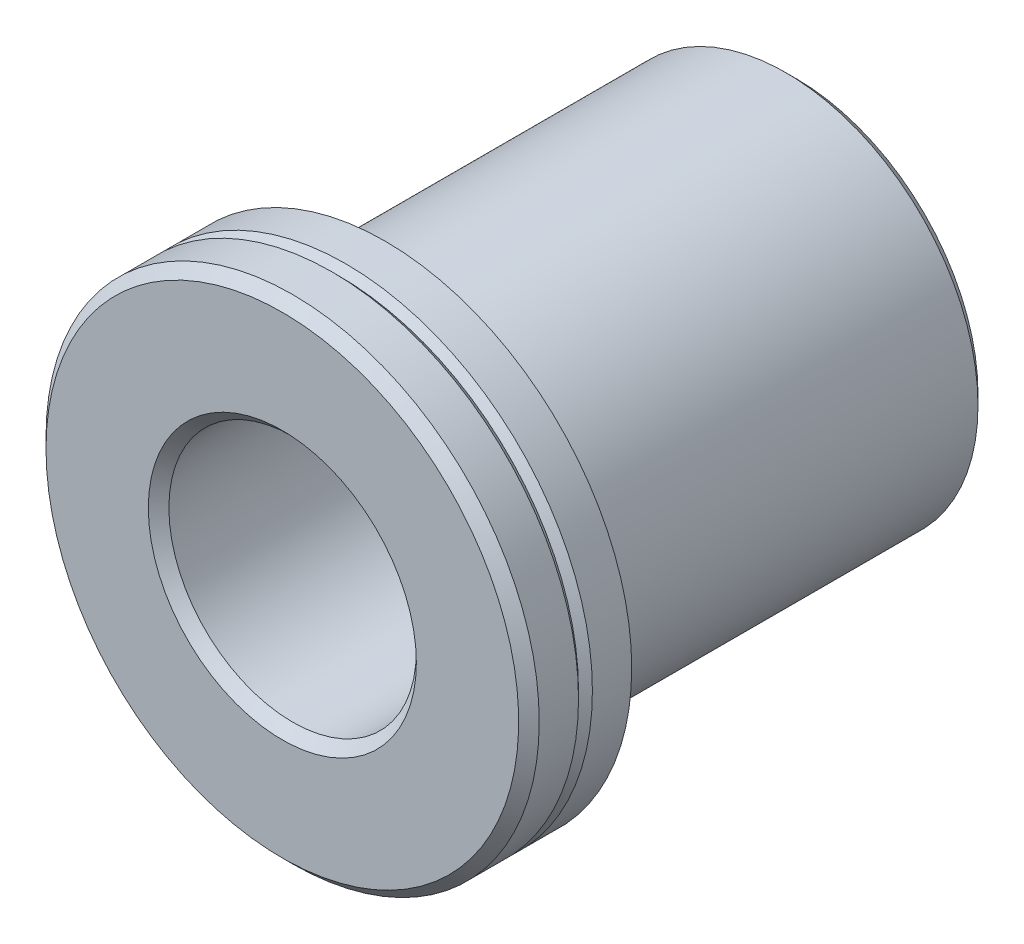
ISO-10303-21;
HEADER;
FILE_DESCRIPTION(('STEP AP214'),'2;1');
FILE_NAME('part.step','',(''),(''),'','','');
FILE_SCHEMA(('AUTOMOTIVE_DESIGN { 1 0 10303 214 1 1 1 1 }'));
ENDSEC;
DATA;
#1=APPLICATION_CONTEXT('core data for automotive mechanical design processes');
#2=APPLICATION_PROTOCOL_DEFINITION('international standard','automotive_design',2000,#1);
#3=PRODUCT_CONTEXT('',#1,'mechanical');
#4=PRODUCT('Part','Part','',(#3));
#5=PRODUCT_RELATED_PRODUCT_CATEGORY('part','',(#4));
#6=PRODUCT_DEFINITION_FORMATION('','',#4);
#7=PRODUCT_DEFINITION_CONTEXT('part definition',#1,'design');
#8=PRODUCT_DEFINITION('design','',#6,#7);
#9=PRODUCT_DEFINITION_SHAPE('','',#8);
#10=(LENGTH_UNIT() NAMED_UNIT(*) SI_UNIT(.MILLI.,.METRE.));
#11=(NAMED_UNIT(*) PLANE_ANGLE_UNIT() SI_UNIT($,.RADIAN.));
#12=(NAMED_UNIT(*) SI_UNIT($,.STERADIAN.) SOLID_ANGLE_UNIT());
#13=UNCERTAINTY_MEASURE_WITH_UNIT(LENGTH_MEASURE(1.E-05),#10,'distance_accuracy_value','');
#14=(GEOMETRIC_REPRESENTATION_CONTEXT(3) GLOBAL_UNCERTAINTY_ASSIGNED_CONTEXT((#13)) GLOBAL_UNIT_ASSIGNED_CONTEXT((#10,
#11,#12)) REPRESENTATION_CONTEXT('',''));
#15=CARTESIAN_POINT('',(0.,0.,0.));
#16=DIRECTION('',(0.,0.,1.));
#17=DIRECTION('',(1.,0.,0.));
#18=AXIS2_PLACEMENT_3D('',#15,#16,#17);
#19=CARTESIAN_POINT('',(0.,0.,6.35));
#20=DIRECTION('',(0.,0.,1.));
#21=DIRECTION('',(1.,0.,0.));
#22=AXIS2_PLACEMENT_3D('',#19,#20,#21);
#23=CYLINDRICAL_SURFACE('',#22,6.096);
#24=CARTESIAN_POINT('',(0.,0.,6.096));
#25=DIRECTION('',(0.,0.,-1.));
#26=DIRECTION('',(-1.,0.,0.));
#27=AXIS2_PLACEMENT_3D('',#24,#25,#26);
#28=CIRCLE('',#27,6.096);
#29=CARTESIAN_POINT('',(-6.096,0.,6.096));
#30=VERTEX_POINT('',#29);
#31=EDGE_CURVE('E9',#30,#30,#28,.T.);
#32=ORIENTED_EDGE('',*,*,#31,.T.);
#33=EDGE_LOOP('',(#32));
#34=FACE_BOUND('',#33,.T.);
#35=CARTESIAN_POINT('',(0.,0.,5.12445));
#36=DIRECTION('',(0.,0.,1.));
#37=DIRECTION('',(1.,0.,0.));
#38=AXIS2_PLACEMENT_3D('',#35,#36,#37);
#39=CIRCLE('',#38,6.096);
#40=CARTESIAN_POINT('',(6.096,0.,5.12445));
#41=VERTEX_POINT('',#40);
#42=EDGE_CURVE('E57',#41,#41,#39,.T.);
#43=ORIENTED_EDGE('',*,*,#42,.T.);
#44=EDGE_LOOP('',(#43));
#45=FACE_BOUND('',#44,.T.);
#46=ADVANCED_FACE('F13',(#34,#45),#23,.T.);
#47=CARTESIAN_POINT('',(0.,0.,3.81));
#48=DIRECTION('',(0.,0.,1.));
#49=DIRECTION('',(1.,0.,0.));
#50=AXIS2_PLACEMENT_3D('',#47,#48,#49);
#51=CIRCLE('',#50,6.096);
#52=CARTESIAN_POINT('',(6.096,0.,3.81));
#53=VERTEX_POINT('',#52);
#54=EDGE_CURVE('E45',#53,#53,#51,.T.);
#55=ORIENTED_EDGE('',*,*,#54,.T.);
#56=EDGE_LOOP('',(#55));
#57=FACE_BOUND('',#56,.T.);
#58=CARTESIAN_POINT('',(0.,0.,4.78155));
#59=DIRECTION('',(0.,0.,1.));
#60=DIRECTION('',(1.,0.,0.));
#61=AXIS2_PLACEMENT_3D('',#58,#59,#60);
#62=CIRCLE('',#61,6.096);
#63=CARTESIAN_POINT('',(6.096,0.,4.78155));
#64=VERTEX_POINT('',#63);
#65=EDGE_CURVE('E63',#64,#64,#62,.T.);
#66=ORIENTED_EDGE('',*,*,#65,.F.);
#67=EDGE_LOOP('',(#66));
#68=FACE_BOUND('',#67,.T.);
#69=ADVANCED_FACE('F70',(#57,#68),#23,.T.);
#70=CARTESIAN_POINT('',(0.,0.,6.35));
#71=DIRECTION('',(0.,0.,1.));
#72=DIRECTION('',(1.,0.,0.));
#73=AXIS2_PLACEMENT_3D('',#70,#71,#72);
#74=CYLINDRICAL_SURFACE('',#73,3.059);
#75=CARTESIAN_POINT('',(0.,0.,6.096));
#76=DIRECTION('',(0.,0.,-1.));
#77=DIRECTION('',(-1.,0.,0.));
#78=AXIS2_PLACEMENT_3D('',#75,#76,#77);
#79=CIRCLE('',#78,3.059);
#80=CARTESIAN_POINT('',(-3.059,0.,6.096));
#81=VERTEX_POINT('',#80);
#82=EDGE_CURVE('E39',#81,#81,#79,.F.);
#83=ORIENTED_EDGE('',*,*,#82,.T.);
#84=EDGE_LOOP('',(#83));
#85=FACE_BOUND('',#84,.T.);
#86=CARTESIAN_POINT('',(0.,0.,-6.096));
#87=DIRECTION('',(0.,0.,1.));
#88=DIRECTION('',(1.,0.,0.));
#89=AXIS2_PLACEMENT_3D('',#86,#87,#88);
#90=CIRCLE('',#89,3.059);
#91=CARTESIAN_POINT('',(3.059,0.,-6.096));
#92=VERTEX_POINT('',#91);
#93=EDGE_CURVE('E42',#92,#92,#90,.F.);
#94=ORIENTED_EDGE('',*,*,#93,.T.);
#95=EDGE_LOOP('',(#94));
#96=FACE_BOUND('',#95,.T.);
#97=ADVANCED_FACE('F72',(#85,#96),#74,.F.);
#98=CARTESIAN_POINT('',(0.,3.059,6.35));
#99=DIRECTION('',(0.,0.,-1.));
#100=DIRECTION('',(-1.,0.,0.));
#101=AXIS2_PLACEMENT_3D('',#98,#99,#100);
#102=PLANE('',#101);
#103=CARTESIAN_POINT('',(0.,0.,6.35));
#104=DIRECTION('',(0.,0.,-1.));
#105=DIRECTION('',(-1.,0.,0.));
#106=AXIS2_PLACEMENT_3D('',#103,#104,#105);
#107=CIRCLE('',#106,3.31299999999999);
#108=CARTESIAN_POINT('',(-3.31299999999999,0.,6.35));
#109=VERTEX_POINT('',#108);
#110=EDGE_CURVE('E33',#109,#109,#107,.T.);
#111=ORIENTED_EDGE('',*,*,#110,.T.);
#112=EDGE_LOOP('',(#111));
#113=FACE_BOUND('',#112,.T.);
#114=CARTESIAN_POINT('',(0.,0.,6.35));
#115=DIRECTION('',(0.,0.,-1.));
#116=DIRECTION('',(-1.,0.,0.));
#117=AXIS2_PLACEMENT_3D('',#114,#115,#116);
#118=CIRCLE('',#117,5.842);
#119=CARTESIAN_POINT('',(-5.842,0.,6.35));
#120=VERTEX_POINT('',#119);
#121=EDGE_CURVE('E36',#120,#120,#118,.F.);
#122=ORIENTED_EDGE('',*,*,#121,.T.);
#123=EDGE_LOOP('',(#122));
#124=FACE_BOUND('',#123,.T.);
#125=ADVANCED_FACE('F80',(#113,#124),#102,.F.);
#126=CARTESIAN_POINT('',(0.,6.096,3.81));
#127=DIRECTION('',(0.,0.,1.));
#128=DIRECTION('',(1.,0.,0.));
#129=AXIS2_PLACEMENT_3D('',#126,#127,#128);
#130=PLANE('',#129);
#131=ORIENTED_EDGE('',*,*,#54,.F.);
#132=EDGE_LOOP('',(#131));
#133=FACE_BOUND('',#132,.T.);
#134=CARTESIAN_POINT('',(0.,0.,3.81));
#135=DIRECTION('',(0.,0.,1.));
#136=DIRECTION('',(1.,0.,0.));
#137=AXIS2_PLACEMENT_3D('',#134,#135,#136);
#138=CIRCLE('',#137,4.4958);
#139=CARTESIAN_POINT('',(4.4958,0.,3.81));
#140=VERTEX_POINT('',#139);
#141=EDGE_CURVE('E48',#140,#140,#138,.T.);
#142=ORIENTED_EDGE('',*,*,#141,.T.);
#143=EDGE_LOOP('',(#142));
#144=FACE_BOUND('',#143,.T.);
#145=ADVANCED_FACE('F85',(#133,#144),#130,.F.);
#146=CARTESIAN_POINT('',(0.,0.,6.35));
#147=DIRECTION('',(0.,0.,1.));
#148=DIRECTION('',(1.,0.,0.));
#149=AXIS2_PLACEMENT_3D('',#146,#147,#148);
#150=CYLINDRICAL_SURFACE('',#149,4.4958);
#151=ORIENTED_EDGE('',*,*,#141,.F.);
#152=EDGE_LOOP('',(#151));
#153=FACE_BOUND('',#152,.T.);
#154=CARTESIAN_POINT('',(0.,0.,3.048));
#155=DIRECTION('',(0.,0.,1.));
#156=DIRECTION('',(1.,0.,0.));
#157=AXIS2_PLACEMENT_3D('',#154,#155,#156);
#158=CIRCLE('',#157,4.4958);
#159=CARTESIAN_POINT('',(4.4958,0.,3.048));
#160=VERTEX_POINT('',#159);
#161=EDGE_CURVE('E51',#160,#160,#158,.T.);
#162=ORIENTED_EDGE('',*,*,#161,.T.);
#163=EDGE_LOOP('',(#162));
#164=FACE_BOUND('',#163,.T.);
#165=ADVANCED_FACE('F122',(#153,#164),#150,.T.);
#166=CARTESIAN_POINT('',(0.,4.4958,3.048));
#167=DIRECTION('',(0.,0.,-1.));
#168=DIRECTION('',(-1.,0.,0.));
#169=AXIS2_PLACEMENT_3D('',#166,#167,#168);
#170=PLANE('',#169);
#171=ORIENTED_EDGE('',*,*,#161,.F.);
#172=EDGE_LOOP('',(#171));
#173=FACE_BOUND('',#172,.T.);
#174=CARTESIAN_POINT('',(0.,0.,3.048));
#175=DIRECTION('',(0.,0.,1.));
#176=DIRECTION('',(1.,0.,0.));
#177=AXIS2_PLACEMENT_3D('',#174,#175,#176);
#178=CIRCLE('',#177,4.7498);
#179=CARTESIAN_POINT('',(4.7498,0.,3.048));
#180=VERTEX_POINT('',#179);
#181=EDGE_CURVE('E54',#180,#180,#178,.T.);
#182=ORIENTED_EDGE('',*,*,#181,.T.);
#183=EDGE_LOOP('',(#182));
#184=FACE_BOUND('',#183,.T.);
#185=ADVANCED_FACE('F116',(#173,#184),#170,.F.);
#186=CARTESIAN_POINT('',(0.,0.,6.35));
#187=DIRECTION('',(0.,0.,1.));
#188=DIRECTION('',(1.,0.,0.));
#189=AXIS2_PLACEMENT_3D('',#186,#187,#188);
#190=CYLINDRICAL_SURFACE('',#189,4.7498);
#191=CARTESIAN_POINT('',(0.,0.,-6.096));
#192=DIRECTION('',(0.,0.,1.));
#193=DIRECTION('',(1.,0.,0.));
#194=AXIS2_PLACEMENT_3D('',#191,#192,#193);
#195=CIRCLE('',#194,4.7498);
#196=CARTESIAN_POINT('',(4.7498,0.,-6.096));
#197=VERTEX_POINT('',#196);
#198=EDGE_CURVE('E20',#197,#197,#195,.T.);
#199=ORIENTED_EDGE('',*,*,#198,.T.);
#200=EDGE_LOOP('',(#199));
#201=FACE_BOUND('',#200,.T.);
#202=ORIENTED_EDGE('',*,*,#181,.F.);
#203=EDGE_LOOP('',(#202));
#204=FACE_BOUND('',#203,.T.);
#205=ADVANCED_FACE('F110',(#201,#204),#190,.T.);
#206=CARTESIAN_POINT('',(0.,4.7498,-6.35));
#207=DIRECTION('',(0.,0.,1.));
#208=DIRECTION('',(1.,0.,0.));
#209=AXIS2_PLACEMENT_3D('',#206,#207,#208);
#210=PLANE('',#209);
#211=CARTESIAN_POINT('',(0.,0.,-6.35));
#212=DIRECTION('',(0.,0.,1.));
#213=DIRECTION('',(1.,0.,0.));
#214=AXIS2_PLACEMENT_3D('',#211,#212,#213);
#215=CIRCLE('',#214,3.313);
#216=CARTESIAN_POINT('',(3.313,0.,-6.35));
#217=VERTEX_POINT('',#216);
#218=EDGE_CURVE('E24',#217,#217,#215,.T.);
#219=ORIENTED_EDGE('',*,*,#218,.T.);
#220=EDGE_LOOP('',(#219));
#221=FACE_BOUND('',#220,.T.);
#222=CARTESIAN_POINT('',(0.,0.,-6.35));
#223=DIRECTION('',(0.,0.,1.));
#224=DIRECTION('',(1.,0.,0.));
#225=AXIS2_PLACEMENT_3D('',#222,#223,#224);
#226=CIRCLE('',#225,4.4958);
#227=CARTESIAN_POINT('',(4.4958,0.,-6.35));
#228=VERTEX_POINT('',#227);
#229=EDGE_CURVE('E28',#228,#228,#226,.F.);
#230=ORIENTED_EDGE('',*,*,#229,.T.);
#231=EDGE_LOOP('',(#230));
#232=FACE_BOUND('',#231,.T.);
#233=ADVANCED_FACE('F94',(#221,#232),#210,.F.);
#234=CARTESIAN_POINT('',(0.,0.,6.096));
#235=DIRECTION('',(0.,0.,1.));
#236=DIRECTION('',(1.,0.,0.));
#237=AXIS2_PLACEMENT_3D('',#234,#235,#236);
#238=CONICAL_SURFACE('',#237,3.059,0.785398163397445);
#239=ORIENTED_EDGE('',*,*,#110,.F.);
#240=EDGE_LOOP('',(#239));
#241=FACE_BOUND('',#240,.T.);
#242=ORIENTED_EDGE('',*,*,#82,.F.);
#243=EDGE_LOOP('',(#242));
#244=FACE_BOUND('',#243,.T.);
#245=ADVANCED_FACE('F90',(#241,#244),#238,.F.);
#246=CARTESIAN_POINT('',(0.,0.,-6.35));
#247=DIRECTION('',(0.,0.,-1.));
#248=DIRECTION('',(-1.,0.,0.));
#249=AXIS2_PLACEMENT_3D('',#246,#247,#248);
#250=CONICAL_SURFACE('',#249,3.313,0.785398163397443);
#251=ORIENTED_EDGE('',*,*,#93,.F.);
#252=EDGE_LOOP('',(#251));
#253=FACE_BOUND('',#252,.T.);
#254=ORIENTED_EDGE('',*,*,#218,.F.);
#255=EDGE_LOOP('',(#254));
#256=FACE_BOUND('',#255,.T.);
#257=ADVANCED_FACE('F93',(#253,#256),#250,.F.);
#258=CARTESIAN_POINT('',(0.,0.,-6.096));
#259=DIRECTION('',(0.,0.,1.));
#260=DIRECTION('',(1.,0.,0.));
#261=AXIS2_PLACEMENT_3D('',#258,#259,#260);
#262=CONICAL_SURFACE('',#261,4.7498,0.785398163397445);
#263=ORIENTED_EDGE('',*,*,#229,.F.);
#264=EDGE_LOOP('',(#263));
#265=FACE_BOUND('',#264,.T.);
#266=ORIENTED_EDGE('',*,*,#198,.F.);
#267=EDGE_LOOP('',(#266));
#268=FACE_BOUND('',#267,.T.);
#269=ADVANCED_FACE('F97',(#265,#268),#262,.T.);
#270=CARTESIAN_POINT('',(0.,0.,6.35));
#271=DIRECTION('',(0.,0.,-1.));
#272=DIRECTION('',(-1.,0.,0.));
#273=AXIS2_PLACEMENT_3D('',#270,#271,#272);
#274=CONICAL_SURFACE('',#273,5.842,0.78539816339745);
#275=ORIENTED_EDGE('',*,*,#31,.F.);
#276=EDGE_LOOP('',(#275));
#277=FACE_BOUND('',#276,.T.);
#278=ORIENTED_EDGE('',*,*,#121,.F.);
#279=EDGE_LOOP('',(#278));
#280=FACE_BOUND('',#279,.T.);
#281=ADVANCED_FACE('F15',(#277,#280),#274,.T.);
#282=CARTESIAN_POINT('',(0.,0.,5.12445));
#283=DIRECTION('',(0.,0.,1.));
#284=DIRECTION('',(1.,0.,0.));
#285=AXIS2_PLACEMENT_3D('',#282,#283,#284);
#286=CONICAL_SURFACE('',#285,6.096,0.785398163397423);
#287=CARTESIAN_POINT('',(0.,0.,4.953));
#288=DIRECTION('',(0.,0.,1.));
#289=DIRECTION('',(1.,0.,0.));
#290=AXIS2_PLACEMENT_3D('',#287,#288,#289);
#291=CIRCLE('',#290,5.92455);
#292=CARTESIAN_POINT('',(5.92455,0.,4.953));
#293=VERTEX_POINT('',#292);
#294=EDGE_CURVE('E60',#293,#293,#291,.T.);
#295=ORIENTED_EDGE('',*,*,#294,.T.);
#296=EDGE_LOOP('',(#295));
#297=FACE_BOUND('',#296,.T.);
#298=ORIENTED_EDGE('',*,*,#42,.F.);
#299=EDGE_LOOP('',(#298));
#300=FACE_BOUND('',#299,.T.);
#301=ADVANCED_FACE('F104',(#297,#300),#286,.T.);
#302=CARTESIAN_POINT('',(0.,0.,4.953));
#303=DIRECTION('',(0.,0.,-1.));
#304=DIRECTION('',(-1.,0.,0.));
#305=AXIS2_PLACEMENT_3D('',#302,#303,#304);
#306=CONICAL_SURFACE('',#305,5.92455,0.785398163397458);
#307=ORIENTED_EDGE('',*,*,#65,.T.);
#308=EDGE_LOOP('',(#307));
#309=FACE_BOUND('',#308,.T.);
#310=ORIENTED_EDGE('',*,*,#294,.F.);
#311=EDGE_LOOP('',(#310));
#312=FACE_BOUND('',#311,.T.);
#313=ADVANCED_FACE('F67',(#309,#312),#306,.T.);
#314=CLOSED_SHELL('',(#46,#69,#97,#125,#145,#165,#185,#205,#233,#245,#257,#269,#281,#301,#313));
#315=MANIFOLD_SOLID_BREP('B1',#314);
#316=ADVANCED_BREP_SHAPE_REPRESENTATION('',(#18,#315),#14);
#317=SHAPE_DEFINITION_REPRESENTATION(#9,#316);
ENDSEC;
END-ISO-10303-21;
